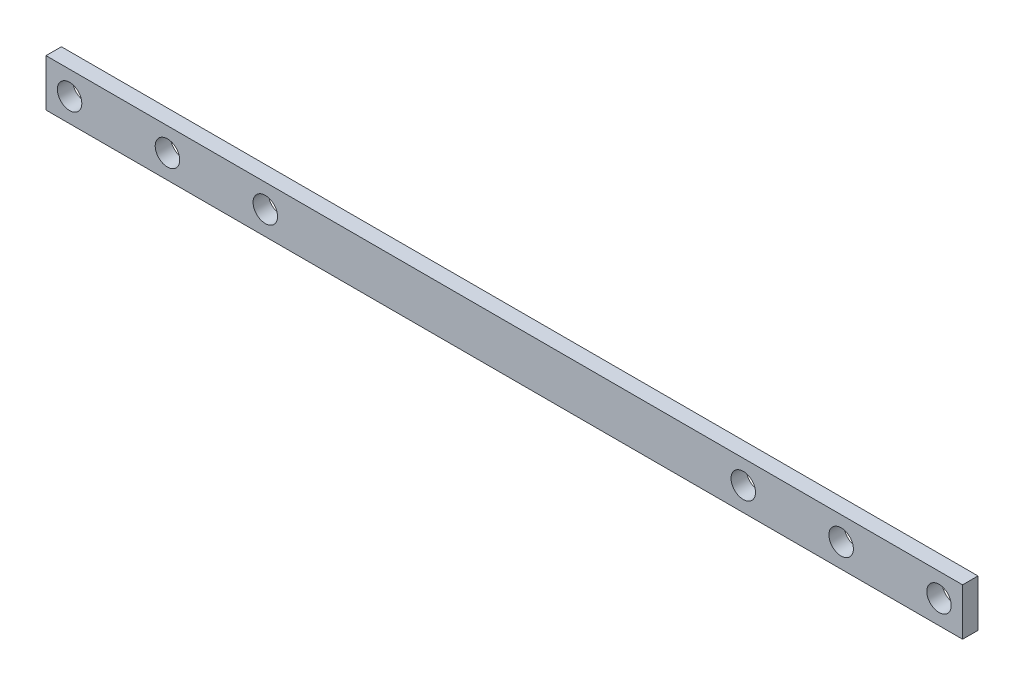
ISO-10303-21;
HEADER;
FILE_DESCRIPTION(('STEP AP214'),'2;1');
FILE_NAME('part.step','',(''),(''),'','','');
FILE_SCHEMA(('AUTOMOTIVE_DESIGN { 1 0 10303 214 1 1 1 1 }'));
ENDSEC;
DATA;
#1=APPLICATION_CONTEXT('core data for automotive mechanical design processes');
#2=APPLICATION_PROTOCOL_DEFINITION('international standard','automotive_design',2000,#1);
#3=PRODUCT_CONTEXT('',#1,'mechanical');
#4=PRODUCT('Part','Part','',(#3));
#5=PRODUCT_RELATED_PRODUCT_CATEGORY('part','',(#4));
#6=PRODUCT_DEFINITION_FORMATION('','',#4);
#7=PRODUCT_DEFINITION_CONTEXT('part definition',#1,'design');
#8=PRODUCT_DEFINITION('design','',#6,#7);
#9=PRODUCT_DEFINITION_SHAPE('','',#8);
#10=(LENGTH_UNIT() NAMED_UNIT(*) SI_UNIT(.MILLI.,.METRE.));
#11=(NAMED_UNIT(*) PLANE_ANGLE_UNIT() SI_UNIT($,.RADIAN.));
#12=(NAMED_UNIT(*) SI_UNIT($,.STERADIAN.) SOLID_ANGLE_UNIT());
#13=UNCERTAINTY_MEASURE_WITH_UNIT(LENGTH_MEASURE(1.E-05),#10,'distance_accuracy_value','');
#14=(GEOMETRIC_REPRESENTATION_CONTEXT(3) GLOBAL_UNCERTAINTY_ASSIGNED_CONTEXT((#13)) GLOBAL_UNIT_ASSIGNED_CONTEXT((#10,
#11,#12)) REPRESENTATION_CONTEXT('',''));
#15=CARTESIAN_POINT('',(0.,0.,0.));
#16=DIRECTION('',(0.,0.,1.));
#17=DIRECTION('',(1.,0.,0.));
#18=AXIS2_PLACEMENT_3D('',#15,#16,#17);
#19=CARTESIAN_POINT('',(0.,0.,2.));
#20=DIRECTION('',(0.,0.,-1.));
#21=DIRECTION('',(-1.,0.,0.));
#22=AXIS2_PLACEMENT_3D('',#19,#20,#21);
#23=PLANE('',#22);
#24=DIRECTION('',(0.,-1.,0.));
#25=VECTOR('',#24,1.);
#26=CARTESIAN_POINT('',(-149.472500000001,30.1112757999462,2.));
#27=LINE('',#26,#25);
#28=CARTESIAN_POINT('',(-149.472500000001,36.2312757999462,2.));
#29=VERTEX_POINT('',#28);
#30=CARTESIAN_POINT('',(-149.472500000001,30.1112757999462,2.));
#31=VERTEX_POINT('',#30);
#32=EDGE_CURVE('E92',#29,#31,#27,.T.);
#33=ORIENTED_EDGE('',*,*,#32,.T.);
#34=DIRECTION('',(1.,0.,0.));
#35=VECTOR('',#34,1.);
#36=CARTESIAN_POINT('',(-30.5275000000013,30.1112757999462,2.));
#37=LINE('',#36,#35);
#38=CARTESIAN_POINT('',(-30.5275000000013,30.1112757999462,2.));
#39=VERTEX_POINT('',#38);
#40=EDGE_CURVE('E87',#31,#39,#37,.T.);
#41=ORIENTED_EDGE('',*,*,#40,.T.);
#42=DIRECTION('',(0.,1.,0.));
#43=VECTOR('',#42,1.);
#44=CARTESIAN_POINT('',(-30.5275000000013,36.2312757999462,2.));
#45=LINE('',#44,#43);
#46=CARTESIAN_POINT('',(-30.5275000000013,36.2312757999462,2.));
#47=VERTEX_POINT('',#46);
#48=EDGE_CURVE('E90',#39,#47,#45,.T.);
#49=ORIENTED_EDGE('',*,*,#48,.T.);
#50=DIRECTION('',(-1.,0.,0.));
#51=VECTOR('',#50,1.);
#52=CARTESIAN_POINT('',(-149.472500000001,36.2312757999462,2.));
#53=LINE('',#52,#51);
#54=EDGE_CURVE('E57',#47,#29,#53,.T.);
#55=ORIENTED_EDGE('',*,*,#54,.T.);
#56=EDGE_LOOP('',(#33,#41,#49,#55));
#57=FACE_BOUND('',#56,.T.);
#58=CARTESIAN_POINT('',(-146.412500000001,33.1749999999992,2.));
#59=DIRECTION('',(0.,0.,1.));
#60=DIRECTION('',(1.,0.,0.));
#61=AXIS2_PLACEMENT_3D('',#58,#59,#60);
#62=CIRCLE('',#61,1.58749999999996);
#63=CARTESIAN_POINT('',(-144.825000000001,33.1749999999992,2.));
#64=VERTEX_POINT('',#63);
#65=EDGE_CURVE('E112',#64,#64,#62,.T.);
#66=ORIENTED_EDGE('',*,*,#65,.F.);
#67=EDGE_LOOP('',(#66));
#68=FACE_BOUND('',#67,.T.);
#69=CARTESIAN_POINT('',(-133.712500000001,33.1749999999991,2.));
#70=DIRECTION('',(0.,0.,1.));
#71=DIRECTION('',(1.,0.,0.));
#72=AXIS2_PLACEMENT_3D('',#69,#70,#71);
#73=CIRCLE('',#72,1.58749999999999);
#74=CARTESIAN_POINT('',(-132.125000000001,33.1749999999991,2.));
#75=VERTEX_POINT('',#74);
#76=EDGE_CURVE('E134',#75,#75,#73,.T.);
#77=ORIENTED_EDGE('',*,*,#76,.F.);
#78=EDGE_LOOP('',(#77));
#79=FACE_BOUND('',#78,.T.);
#80=CARTESIAN_POINT('',(-121.012500000001,33.1749999999992,2.));
#81=DIRECTION('',(0.,0.,1.));
#82=DIRECTION('',(1.,0.,0.));
#83=AXIS2_PLACEMENT_3D('',#80,#81,#82);
#84=CIRCLE('',#83,1.58749999999999);
#85=CARTESIAN_POINT('',(-119.425000000001,33.1749999999992,2.));
#86=VERTEX_POINT('',#85);
#87=EDGE_CURVE('E142',#86,#86,#84,.T.);
#88=ORIENTED_EDGE('',*,*,#87,.F.);
#89=EDGE_LOOP('',(#88));
#90=FACE_BOUND('',#89,.T.);
#91=CARTESIAN_POINT('',(-58.9875000000013,33.1749999999997,2.));
#92=DIRECTION('',(0.,0.,1.));
#93=DIRECTION('',(1.,0.,0.));
#94=AXIS2_PLACEMENT_3D('',#91,#92,#93);
#95=CIRCLE('',#94,1.58750000000123);
#96=CARTESIAN_POINT('',(-57.4,33.1749999999997,2.));
#97=VERTEX_POINT('',#96);
#98=EDGE_CURVE('E150',#97,#97,#95,.T.);
#99=ORIENTED_EDGE('',*,*,#98,.F.);
#100=EDGE_LOOP('',(#99));
#101=FACE_BOUND('',#100,.T.);
#102=CARTESIAN_POINT('',(-46.2875000000013,33.1749999999996,2.));
#103=DIRECTION('',(0.,0.,1.));
#104=DIRECTION('',(1.,0.,0.));
#105=AXIS2_PLACEMENT_3D('',#102,#103,#104);
#106=CIRCLE('',#105,1.58750000000122);
#107=CARTESIAN_POINT('',(-44.7000000000001,33.1749999999996,2.));
#108=VERTEX_POINT('',#107);
#109=EDGE_CURVE('E158',#108,#108,#106,.T.);
#110=ORIENTED_EDGE('',*,*,#109,.F.);
#111=EDGE_LOOP('',(#110));
#112=FACE_BOUND('',#111,.T.);
#113=CARTESIAN_POINT('',(-33.5875000000013,33.1749999999995,2.));
#114=DIRECTION('',(0.,0.,1.));
#115=DIRECTION('',(1.,0.,0.));
#116=AXIS2_PLACEMENT_3D('',#113,#114,#115);
#117=CIRCLE('',#116,1.58750000000121);
#118=CARTESIAN_POINT('',(-32.0000000000001,33.1749999999995,2.));
#119=VERTEX_POINT('',#118);
#120=EDGE_CURVE('E166',#119,#119,#117,.T.);
#121=ORIENTED_EDGE('',*,*,#120,.F.);
#122=EDGE_LOOP('',(#121));
#123=FACE_BOUND('',#122,.T.);
#124=ADVANCED_FACE('F39',(#57,#68,#79,#90,#101,#112,#123),#23,.F.);
#125=CARTESIAN_POINT('',(0.,0.,0.));
#126=DIRECTION('',(0.,0.,-1.));
#127=DIRECTION('',(-1.,0.,0.));
#128=AXIS2_PLACEMENT_3D('',#125,#126,#127);
#129=PLANE('',#128);
#130=CARTESIAN_POINT('',(-46.2875000000013,33.1749999999996,0.));
#131=DIRECTION('',(0.,0.,1.));
#132=DIRECTION('',(1.,0.,0.));
#133=AXIS2_PLACEMENT_3D('',#130,#131,#132);
#134=CIRCLE('',#133,1.58750000000122);
#135=CARTESIAN_POINT('',(-44.7000000000001,33.1749999999996,0.));
#136=VERTEX_POINT('',#135);
#137=EDGE_CURVE('E162',#136,#136,#134,.T.);
#138=ORIENTED_EDGE('',*,*,#137,.T.);
#139=EDGE_LOOP('',(#138));
#140=FACE_BOUND('',#139,.T.);
#141=CARTESIAN_POINT('',(-121.012500000001,33.1749999999992,0.));
#142=DIRECTION('',(0.,0.,1.));
#143=DIRECTION('',(1.,0.,0.));
#144=AXIS2_PLACEMENT_3D('',#141,#142,#143);
#145=CIRCLE('',#144,1.58749999999999);
#146=CARTESIAN_POINT('',(-119.425000000001,33.1749999999992,0.));
#147=VERTEX_POINT('',#146);
#148=EDGE_CURVE('E146',#147,#147,#145,.T.);
#149=ORIENTED_EDGE('',*,*,#148,.T.);
#150=EDGE_LOOP('',(#149));
#151=FACE_BOUND('',#150,.T.);
#152=CARTESIAN_POINT('',(-146.412500000001,33.1749999999992,0.));
#153=DIRECTION('',(0.,0.,1.));
#154=DIRECTION('',(1.,0.,0.));
#155=AXIS2_PLACEMENT_3D('',#152,#153,#154);
#156=CIRCLE('',#155,1.58749999999996);
#157=CARTESIAN_POINT('',(-144.825000000001,33.1749999999992,0.));
#158=VERTEX_POINT('',#157);
#159=EDGE_CURVE('E130',#158,#158,#156,.T.);
#160=ORIENTED_EDGE('',*,*,#159,.T.);
#161=EDGE_LOOP('',(#160));
#162=FACE_BOUND('',#161,.T.);
#163=DIRECTION('',(0.,-1.,0.));
#164=VECTOR('',#163,1.);
#165=CARTESIAN_POINT('',(-149.472500000001,30.1112757999462,0.));
#166=LINE('',#165,#164);
#167=CARTESIAN_POINT('',(-149.472500000001,36.2312757999462,0.));
#168=VERTEX_POINT('',#167);
#169=CARTESIAN_POINT('',(-149.472500000001,30.1112757999462,0.));
#170=VERTEX_POINT('',#169);
#171=EDGE_CURVE('E108',#168,#170,#166,.T.);
#172=ORIENTED_EDGE('',*,*,#171,.F.);
#173=DIRECTION('',(-1.,0.,0.));
#174=VECTOR('',#173,1.);
#175=CARTESIAN_POINT('',(-149.472500000001,36.2312757999462,0.));
#176=LINE('',#175,#174);
#177=CARTESIAN_POINT('',(-30.5275000000013,36.2312757999462,0.));
#178=VERTEX_POINT('',#177);
#179=EDGE_CURVE('E80',#178,#168,#176,.T.);
#180=ORIENTED_EDGE('',*,*,#179,.F.);
#181=DIRECTION('',(0.,1.,0.));
#182=VECTOR('',#181,1.);
#183=CARTESIAN_POINT('',(-30.5275000000013,36.2312757999462,0.));
#184=LINE('',#183,#182);
#185=CARTESIAN_POINT('',(-30.5275000000013,30.1112757999462,0.));
#186=VERTEX_POINT('',#185);
#187=EDGE_CURVE('E74',#186,#178,#184,.T.);
#188=ORIENTED_EDGE('',*,*,#187,.F.);
#189=DIRECTION('',(1.,0.,0.));
#190=VECTOR('',#189,1.);
#191=CARTESIAN_POINT('',(-30.5275000000013,30.1112757999462,0.));
#192=LINE('',#191,#190);
#193=EDGE_CURVE('E97',#170,#186,#192,.T.);
#194=ORIENTED_EDGE('',*,*,#193,.F.);
#195=EDGE_LOOP('',(#172,#180,#188,#194));
#196=FACE_BOUND('',#195,.T.);
#197=CARTESIAN_POINT('',(-133.712500000001,33.1749999999991,0.));
#198=DIRECTION('',(0.,0.,1.));
#199=DIRECTION('',(1.,0.,0.));
#200=AXIS2_PLACEMENT_3D('',#197,#198,#199);
#201=CIRCLE('',#200,1.58749999999999);
#202=CARTESIAN_POINT('',(-132.125000000001,33.1749999999991,0.));
#203=VERTEX_POINT('',#202);
#204=EDGE_CURVE('E138',#203,#203,#201,.T.);
#205=ORIENTED_EDGE('',*,*,#204,.T.);
#206=EDGE_LOOP('',(#205));
#207=FACE_BOUND('',#206,.T.);
#208=CARTESIAN_POINT('',(-58.9875000000013,33.1749999999997,0.));
#209=DIRECTION('',(0.,0.,1.));
#210=DIRECTION('',(1.,0.,0.));
#211=AXIS2_PLACEMENT_3D('',#208,#209,#210);
#212=CIRCLE('',#211,1.58750000000123);
#213=CARTESIAN_POINT('',(-57.4,33.1749999999997,0.));
#214=VERTEX_POINT('',#213);
#215=EDGE_CURVE('E154',#214,#214,#212,.T.);
#216=ORIENTED_EDGE('',*,*,#215,.T.);
#217=EDGE_LOOP('',(#216));
#218=FACE_BOUND('',#217,.T.);
#219=CARTESIAN_POINT('',(-33.5875000000013,33.1749999999995,0.));
#220=DIRECTION('',(0.,0.,1.));
#221=DIRECTION('',(1.,0.,0.));
#222=AXIS2_PLACEMENT_3D('',#219,#220,#221);
#223=CIRCLE('',#222,1.58750000000121);
#224=CARTESIAN_POINT('',(-32.0000000000001,33.1749999999995,0.));
#225=VERTEX_POINT('',#224);
#226=EDGE_CURVE('E170',#225,#225,#223,.T.);
#227=ORIENTED_EDGE('',*,*,#226,.T.);
#228=EDGE_LOOP('',(#227));
#229=FACE_BOUND('',#228,.T.);
#230=ADVANCED_FACE('F125',(#140,#151,#162,#196,#207,#218,#229),#129,.T.);
#231=CARTESIAN_POINT('',(-149.472500000001,30.1112757999462,2.));
#232=DIRECTION('',(1.,0.,0.));
#233=DIRECTION('',(0.,0.,-1.));
#234=AXIS2_PLACEMENT_3D('',#231,#232,#233);
#235=PLANE('',#234);
#236=ORIENTED_EDGE('',*,*,#171,.T.);
#237=DIRECTION('',(0.,0.,-1.));
#238=VECTOR('',#237,1.);
#239=CARTESIAN_POINT('',(-149.472500000001,30.1112757999462,2.));
#240=LINE('',#239,#238);
#241=EDGE_CURVE('E11',#31,#170,#240,.T.);
#242=ORIENTED_EDGE('',*,*,#241,.F.);
#243=ORIENTED_EDGE('',*,*,#32,.F.);
#244=DIRECTION('',(0.,0.,-1.));
#245=VECTOR('',#244,1.);
#246=CARTESIAN_POINT('',(-149.472500000001,36.2312757999462,2.));
#247=LINE('',#246,#245);
#248=EDGE_CURVE('E104',#29,#168,#247,.T.);
#249=ORIENTED_EDGE('',*,*,#248,.T.);
#250=EDGE_LOOP('',(#236,#242,#243,#249));
#251=FACE_BOUND('',#250,.T.);
#252=ADVANCED_FACE('F41',(#251),#235,.F.);
#253=CARTESIAN_POINT('',(-30.5275000000013,30.1112757999462,2.));
#254=DIRECTION('',(0.,1.,0.));
#255=DIRECTION('',(0.,0.,1.));
#256=AXIS2_PLACEMENT_3D('',#253,#254,#255);
#257=PLANE('',#256);
#258=ORIENTED_EDGE('',*,*,#193,.T.);
#259=DIRECTION('',(0.,0.,-1.));
#260=VECTOR('',#259,1.);
#261=CARTESIAN_POINT('',(-30.5275000000013,30.1112757999462,2.));
#262=LINE('',#261,#260);
#263=EDGE_CURVE('E49',#39,#186,#262,.T.);
#264=ORIENTED_EDGE('',*,*,#263,.F.);
#265=ORIENTED_EDGE('',*,*,#40,.F.);
#266=ORIENTED_EDGE('',*,*,#241,.T.);
#267=EDGE_LOOP('',(#258,#264,#265,#266));
#268=FACE_BOUND('',#267,.T.);
#269=ADVANCED_FACE('F96',(#268),#257,.F.);
#270=CARTESIAN_POINT('',(-30.5275000000013,36.2312757999462,2.));
#271=DIRECTION('',(-1.,0.,0.));
#272=DIRECTION('',(0.,0.,1.));
#273=AXIS2_PLACEMENT_3D('',#270,#271,#272);
#274=PLANE('',#273);
#275=ORIENTED_EDGE('',*,*,#187,.T.);
#276=DIRECTION('',(0.,0.,-1.));
#277=VECTOR('',#276,1.);
#278=CARTESIAN_POINT('',(-30.5275000000013,36.2312757999462,2.));
#279=LINE('',#278,#277);
#280=EDGE_CURVE('E99',#47,#178,#279,.T.);
#281=ORIENTED_EDGE('',*,*,#280,.F.);
#282=ORIENTED_EDGE('',*,*,#48,.F.);
#283=ORIENTED_EDGE('',*,*,#263,.T.);
#284=EDGE_LOOP('',(#275,#281,#282,#283));
#285=FACE_BOUND('',#284,.T.);
#286=ADVANCED_FACE('F100',(#285),#274,.F.);
#287=CARTESIAN_POINT('',(-149.472500000001,36.2312757999462,2.));
#288=DIRECTION('',(0.,-1.,0.));
#289=DIRECTION('',(0.,0.,-1.));
#290=AXIS2_PLACEMENT_3D('',#287,#288,#289);
#291=PLANE('',#290);
#292=ORIENTED_EDGE('',*,*,#179,.T.);
#293=ORIENTED_EDGE('',*,*,#248,.F.);
#294=ORIENTED_EDGE('',*,*,#54,.F.);
#295=ORIENTED_EDGE('',*,*,#280,.T.);
#296=EDGE_LOOP('',(#292,#293,#294,#295));
#297=FACE_BOUND('',#296,.T.);
#298=ADVANCED_FACE('F122',(#297),#291,.F.);
#299=CARTESIAN_POINT('',(-146.412500000001,33.1749999999992,2.));
#300=DIRECTION('',(0.,0.,-1.));
#301=DIRECTION('',(-1.,0.,0.));
#302=AXIS2_PLACEMENT_3D('',#299,#300,#301);
#303=CYLINDRICAL_SURFACE('',#302,1.58749999999996);
#304=ORIENTED_EDGE('',*,*,#65,.T.);
#305=EDGE_LOOP('',(#304));
#306=FACE_BOUND('',#305,.T.);
#307=ORIENTED_EDGE('',*,*,#159,.F.);
#308=EDGE_LOOP('',(#307));
#309=FACE_BOUND('',#308,.T.);
#310=ADVANCED_FACE('F189',(#306,#309),#303,.F.);
#311=CARTESIAN_POINT('',(-133.712500000001,33.1749999999991,2.));
#312=DIRECTION('',(0.,0.,-1.));
#313=DIRECTION('',(-1.,0.,0.));
#314=AXIS2_PLACEMENT_3D('',#311,#312,#313);
#315=CYLINDRICAL_SURFACE('',#314,1.58749999999999);
#316=ORIENTED_EDGE('',*,*,#76,.T.);
#317=EDGE_LOOP('',(#316));
#318=FACE_BOUND('',#317,.T.);
#319=ORIENTED_EDGE('',*,*,#204,.F.);
#320=EDGE_LOOP('',(#319));
#321=FACE_BOUND('',#320,.T.);
#322=ADVANCED_FACE('F235',(#318,#321),#315,.F.);
#323=CARTESIAN_POINT('',(-121.012500000001,33.1749999999992,2.));
#324=DIRECTION('',(0.,0.,-1.));
#325=DIRECTION('',(-1.,0.,0.));
#326=AXIS2_PLACEMENT_3D('',#323,#324,#325);
#327=CYLINDRICAL_SURFACE('',#326,1.58749999999999);
#328=ORIENTED_EDGE('',*,*,#87,.T.);
#329=EDGE_LOOP('',(#328));
#330=FACE_BOUND('',#329,.T.);
#331=ORIENTED_EDGE('',*,*,#148,.F.);
#332=EDGE_LOOP('',(#331));
#333=FACE_BOUND('',#332,.T.);
#334=ADVANCED_FACE('F243',(#330,#333),#327,.F.);
#335=CARTESIAN_POINT('',(-58.9875000000013,33.1749999999997,2.));
#336=DIRECTION('',(0.,0.,-1.));
#337=DIRECTION('',(-1.,0.,0.));
#338=AXIS2_PLACEMENT_3D('',#335,#336,#337);
#339=CYLINDRICAL_SURFACE('',#338,1.58750000000123);
#340=ORIENTED_EDGE('',*,*,#98,.T.);
#341=EDGE_LOOP('',(#340));
#342=FACE_BOUND('',#341,.T.);
#343=ORIENTED_EDGE('',*,*,#215,.F.);
#344=EDGE_LOOP('',(#343));
#345=FACE_BOUND('',#344,.T.);
#346=ADVANCED_FACE('F251',(#342,#345),#339,.F.);
#347=CARTESIAN_POINT('',(-46.2875000000013,33.1749999999996,2.));
#348=DIRECTION('',(0.,0.,-1.));
#349=DIRECTION('',(-1.,0.,0.));
#350=AXIS2_PLACEMENT_3D('',#347,#348,#349);
#351=CYLINDRICAL_SURFACE('',#350,1.58750000000122);
#352=ORIENTED_EDGE('',*,*,#109,.T.);
#353=EDGE_LOOP('',(#352));
#354=FACE_BOUND('',#353,.T.);
#355=ORIENTED_EDGE('',*,*,#137,.F.);
#356=EDGE_LOOP('',(#355));
#357=FACE_BOUND('',#356,.T.);
#358=ADVANCED_FACE('F260',(#354,#357),#351,.F.);
#359=CARTESIAN_POINT('',(-33.5875000000013,33.1749999999995,2.));
#360=DIRECTION('',(0.,0.,-1.));
#361=DIRECTION('',(-1.,0.,0.));
#362=AXIS2_PLACEMENT_3D('',#359,#360,#361);
#363=CYLINDRICAL_SURFACE('',#362,1.58750000000121);
#364=ORIENTED_EDGE('',*,*,#120,.T.);
#365=EDGE_LOOP('',(#364));
#366=FACE_BOUND('',#365,.T.);
#367=ORIENTED_EDGE('',*,*,#226,.F.);
#368=EDGE_LOOP('',(#367));
#369=FACE_BOUND('',#368,.T.);
#370=ADVANCED_FACE('F178',(#366,#369),#363,.F.);
#371=CLOSED_SHELL('',(#124,#230,#252,#269,#286,#298,#310,#322,#334,#346,#358,#370));
#372=MANIFOLD_SOLID_BREP('B2',#371);
#373=ADVANCED_BREP_SHAPE_REPRESENTATION('',(#18,#372),#14);
#374=SHAPE_DEFINITION_REPRESENTATION(#9,#373);
ENDSEC;
END-ISO-10303-21;
